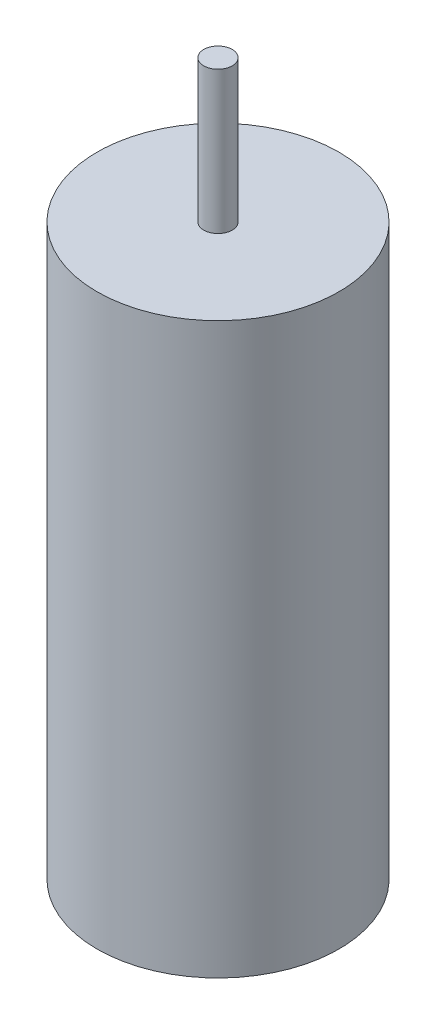
ISO-10303-21;
HEADER;
FILE_DESCRIPTION(('STEP AP214'),'2;1');
FILE_NAME('part.step','',(''),(''),'','','');
FILE_SCHEMA(('AUTOMOTIVE_DESIGN { 1 0 10303 214 1 1 1 1 }'));
ENDSEC;
DATA;
#1=APPLICATION_CONTEXT('core data for automotive mechanical design processes');
#2=APPLICATION_PROTOCOL_DEFINITION('international standard','automotive_design',2000,#1);
#3=PRODUCT_CONTEXT('',#1,'mechanical');
#4=PRODUCT('Part','Part','',(#3));
#5=PRODUCT_RELATED_PRODUCT_CATEGORY('part','',(#4));
#6=PRODUCT_DEFINITION_FORMATION('','',#4);
#7=PRODUCT_DEFINITION_CONTEXT('part definition',#1,'design');
#8=PRODUCT_DEFINITION('design','',#6,#7);
#9=PRODUCT_DEFINITION_SHAPE('','',#8);
#10=(LENGTH_UNIT() NAMED_UNIT(*) SI_UNIT(.MILLI.,.METRE.));
#11=(NAMED_UNIT(*) PLANE_ANGLE_UNIT() SI_UNIT($,.RADIAN.));
#12=(NAMED_UNIT(*) SI_UNIT($,.STERADIAN.) SOLID_ANGLE_UNIT());
#13=UNCERTAINTY_MEASURE_WITH_UNIT(LENGTH_MEASURE(1.E-05),#10,'distance_accuracy_value','');
#14=(GEOMETRIC_REPRESENTATION_CONTEXT(3) GLOBAL_UNCERTAINTY_ASSIGNED_CONTEXT((#13)) GLOBAL_UNIT_ASSIGNED_CONTEXT((#10,
#11,#12)) REPRESENTATION_CONTEXT('',''));
#15=CARTESIAN_POINT('',(0.,0.,0.));
#16=DIRECTION('',(0.,0.,1.));
#17=DIRECTION('',(1.,0.,0.));
#18=AXIS2_PLACEMENT_3D('',#15,#16,#17);
#19=CARTESIAN_POINT('',(0.,20.,0.));
#20=DIRECTION('',(0.,-1.,0.));
#21=DIRECTION('',(0.,0.,-1.));
#22=AXIS2_PLACEMENT_3D('',#19,#20,#21);
#23=CYLINDRICAL_SURFACE('',#22,4.25);
#24=CARTESIAN_POINT('',(0.,20.,0.));
#25=DIRECTION('',(0.,1.,0.));
#26=DIRECTION('',(0.,0.,1.));
#27=AXIS2_PLACEMENT_3D('',#24,#25,#26);
#28=CIRCLE('',#27,4.25);
#29=CARTESIAN_POINT('',(0.,20.,4.25));
#30=VERTEX_POINT('',#29);
#31=EDGE_CURVE('E10',#30,#30,#28,.T.);
#32=ORIENTED_EDGE('',*,*,#31,.F.);
#33=EDGE_LOOP('',(#32));
#34=FACE_BOUND('',#33,.T.);
#35=CARTESIAN_POINT('',(0.,0.,0.));
#36=DIRECTION('',(0.,1.,0.));
#37=DIRECTION('',(0.,0.,1.));
#38=AXIS2_PLACEMENT_3D('',#35,#36,#37);
#39=CIRCLE('',#38,4.25);
#40=CARTESIAN_POINT('',(0.,0.,4.25));
#41=VERTEX_POINT('',#40);
#42=EDGE_CURVE('E33',#41,#41,#39,.T.);
#43=ORIENTED_EDGE('',*,*,#42,.T.);
#44=EDGE_LOOP('',(#43));
#45=FACE_BOUND('',#44,.T.);
#46=ADVANCED_FACE('F30',(#34,#45),#23,.T.);
#47=CARTESIAN_POINT('',(0.,20.,0.));
#48=DIRECTION('',(0.,1.,0.));
#49=DIRECTION('',(0.,0.,1.));
#50=AXIS2_PLACEMENT_3D('',#47,#48,#49);
#51=PLANE('',#50);
#52=CARTESIAN_POINT('',(0.,20.,0.));
#53=DIRECTION('',(0.,1.,0.));
#54=DIRECTION('',(0.,0.,1.));
#55=AXIS2_PLACEMENT_3D('',#52,#53,#54);
#56=CIRCLE('',#55,0.5);
#57=CARTESIAN_POINT('',(0.,20.,0.5));
#58=VERTEX_POINT('',#57);
#59=EDGE_CURVE('E42',#58,#58,#56,.T.);
#60=ORIENTED_EDGE('',*,*,#59,.F.);
#61=EDGE_LOOP('',(#60));
#62=FACE_BOUND('',#61,.T.);
#63=ORIENTED_EDGE('',*,*,#31,.T.);
#64=EDGE_LOOP('',(#63));
#65=FACE_BOUND('',#64,.T.);
#66=ADVANCED_FACE('F57',(#62,#65),#51,.T.);
#67=CARTESIAN_POINT('',(0.,0.,0.));
#68=DIRECTION('',(0.,1.,0.));
#69=DIRECTION('',(0.,0.,1.));
#70=AXIS2_PLACEMENT_3D('',#67,#68,#69);
#71=PLANE('',#70);
#72=ORIENTED_EDGE('',*,*,#42,.F.);
#73=EDGE_LOOP('',(#72));
#74=FACE_BOUND('',#73,.T.);
#75=ADVANCED_FACE('F53',(#74),#71,.F.);
#76=CARTESIAN_POINT('',(0.,25.,0.));
#77=DIRECTION('',(0.,-1.,0.));
#78=DIRECTION('',(0.,0.,-1.));
#79=AXIS2_PLACEMENT_3D('',#76,#77,#78);
#80=CYLINDRICAL_SURFACE('',#79,0.5);
#81=CARTESIAN_POINT('',(0.,25.,0.));
#82=DIRECTION('',(0.,1.,0.));
#83=DIRECTION('',(0.,0.,1.));
#84=AXIS2_PLACEMENT_3D('',#81,#82,#83);
#85=CIRCLE('',#84,0.5);
#86=CARTESIAN_POINT('',(0.,25.,0.5));
#87=VERTEX_POINT('',#86);
#88=EDGE_CURVE('E40',#87,#87,#85,.T.);
#89=ORIENTED_EDGE('',*,*,#88,.F.);
#90=EDGE_LOOP('',(#89));
#91=FACE_BOUND('',#90,.T.);
#92=ORIENTED_EDGE('',*,*,#59,.T.);
#93=EDGE_LOOP('',(#92));
#94=FACE_BOUND('',#93,.T.);
#95=ADVANCED_FACE('F50',(#91,#94),#80,.T.);
#96=CARTESIAN_POINT('',(0.,25.,0.));
#97=DIRECTION('',(0.,1.,0.));
#98=DIRECTION('',(0.,0.,1.));
#99=AXIS2_PLACEMENT_3D('',#96,#97,#98);
#100=PLANE('',#99);
#101=ORIENTED_EDGE('',*,*,#88,.T.);
#102=EDGE_LOOP('',(#101));
#103=FACE_BOUND('',#102,.T.);
#104=ADVANCED_FACE('F48',(#103),#100,.T.);
#105=CLOSED_SHELL('',(#46,#66,#75,#95,#104));
#106=MANIFOLD_SOLID_BREP('B2',#105);
#107=ADVANCED_BREP_SHAPE_REPRESENTATION('',(#18,#106),#14);
#108=SHAPE_DEFINITION_REPRESENTATION(#9,#107);
ENDSEC;
END-ISO-10303-21;
